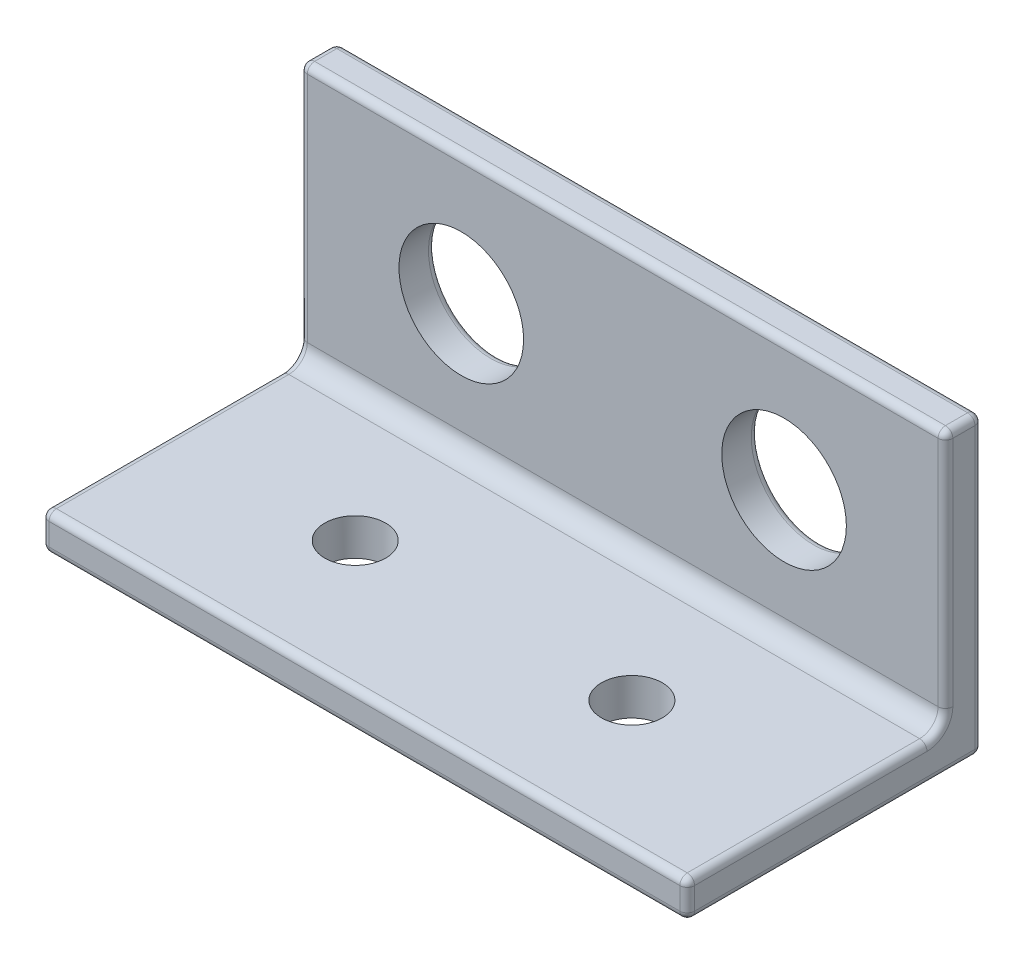
ISO-10303-21;
HEADER;
FILE_DESCRIPTION(('STEP AP214'),'2;1');
FILE_NAME('part.step','',(''),(''),'','','');
FILE_SCHEMA(('AUTOMOTIVE_DESIGN { 1 0 10303 214 1 1 1 1 }'));
ENDSEC;
DATA;
#1=APPLICATION_CONTEXT('core data for automotive mechanical design processes');
#2=APPLICATION_PROTOCOL_DEFINITION('international standard','automotive_design',2000,#1);
#3=PRODUCT_CONTEXT('',#1,'mechanical');
#4=PRODUCT('Part','Part','',(#3));
#5=PRODUCT_RELATED_PRODUCT_CATEGORY('part','',(#4));
#6=PRODUCT_DEFINITION_FORMATION('','',#4);
#7=PRODUCT_DEFINITION_CONTEXT('part definition',#1,'design');
#8=PRODUCT_DEFINITION('design','',#6,#7);
#9=PRODUCT_DEFINITION_SHAPE('','',#8);
#10=(LENGTH_UNIT() NAMED_UNIT(*) SI_UNIT(.MILLI.,.METRE.));
#11=(NAMED_UNIT(*) PLANE_ANGLE_UNIT() SI_UNIT($,.RADIAN.));
#12=(NAMED_UNIT(*) SI_UNIT($,.STERADIAN.) SOLID_ANGLE_UNIT());
#13=UNCERTAINTY_MEASURE_WITH_UNIT(LENGTH_MEASURE(1.E-05),#10,'distance_accuracy_value','');
#14=(GEOMETRIC_REPRESENTATION_CONTEXT(3) GLOBAL_UNCERTAINTY_ASSIGNED_CONTEXT((#13)) GLOBAL_UNIT_ASSIGNED_CONTEXT((#10,
#11,#12)) REPRESENTATION_CONTEXT('',''));
#15=CARTESIAN_POINT('',(0.,0.,0.));
#16=DIRECTION('',(0.,0.,1.));
#17=DIRECTION('',(1.,0.,0.));
#18=AXIS2_PLACEMENT_3D('',#15,#16,#17);
#19=CARTESIAN_POINT('',(17.5,2.,2.));
#20=DIRECTION('',(0.,0.,-1.));
#21=DIRECTION('',(0.,1.,0.));
#22=AXIS2_PLACEMENT_3D('',#19,#20,#21);
#23=PLANE('',#22);
#24=CARTESIAN_POINT('',(-8.75,9.,2.));
#25=DIRECTION('',(0.,0.,1.));
#26=DIRECTION('',(1.,0.,0.));
#27=AXIS2_PLACEMENT_3D('',#24,#25,#26);
#28=CIRCLE('',#27,3.3782);
#29=CARTESIAN_POINT('',(-5.3718,9.,2.));
#30=VERTEX_POINT('',#29);
#31=EDGE_CURVE('E392',#30,#30,#28,.T.);
#32=ORIENTED_EDGE('',*,*,#31,.F.);
#33=EDGE_LOOP('',(#32));
#34=FACE_BOUND('',#33,.T.);
#35=CARTESIAN_POINT('',(8.75,9.,2.));
#36=DIRECTION('',(0.,0.,1.));
#37=DIRECTION('',(1.,0.,0.));
#38=AXIS2_PLACEMENT_3D('',#35,#36,#37);
#39=CIRCLE('',#38,3.3782);
#40=CARTESIAN_POINT('',(12.1282,9.,2.));
#41=VERTEX_POINT('',#40);
#42=EDGE_CURVE('E395',#41,#41,#39,.T.);
#43=ORIENTED_EDGE('',*,*,#42,.F.);
#44=EDGE_LOOP('',(#43));
#45=FACE_BOUND('',#44,.T.);
#46=DIRECTION('',(-1.,0.,0.));
#47=VECTOR('',#46,1.);
#48=CARTESIAN_POINT('',(17.5,15.6,2.));
#49=LINE('',#48,#47);
#50=CARTESIAN_POINT('',(17.1,15.6,2.));
#51=VERTEX_POINT('',#50);
#52=CARTESIAN_POINT('',(-17.1,15.6,2.));
#53=VERTEX_POINT('',#52);
#54=EDGE_CURVE('E241',#51,#53,#49,.T.);
#55=ORIENTED_EDGE('',*,*,#54,.T.);
#56=DIRECTION('',(0.,-1.,0.));
#57=VECTOR('',#56,1.);
#58=CARTESIAN_POINT('',(-17.1,3.,2.));
#59=LINE('',#58,#57);
#60=CARTESIAN_POINT('',(-17.1,3.,2.));
#61=VERTEX_POINT('',#60);
#62=EDGE_CURVE('E244',#53,#61,#59,.T.);
#63=ORIENTED_EDGE('',*,*,#62,.T.);
#64=DIRECTION('',(-1.,0.,0.));
#65=VECTOR('',#64,1.);
#66=CARTESIAN_POINT('',(17.5,3.,2.));
#67=LINE('',#66,#65);
#68=CARTESIAN_POINT('',(17.1,3.,2.));
#69=VERTEX_POINT('',#68);
#70=EDGE_CURVE('E202',#61,#69,#67,.F.);
#71=ORIENTED_EDGE('',*,*,#70,.T.);
#72=DIRECTION('',(0.,-1.,0.));
#73=VECTOR('',#72,1.);
#74=CARTESIAN_POINT('',(17.1,2.,2.));
#75=LINE('',#74,#73);
#76=EDGE_CURVE('E239',#69,#51,#75,.F.);
#77=ORIENTED_EDGE('',*,*,#76,.T.);
#78=EDGE_LOOP('',(#55,#63,#71,#77));
#79=FACE_BOUND('',#78,.T.);
#80=ADVANCED_FACE('F35',(#34,#45,#79),#23,.F.);
#81=CARTESIAN_POINT('',(17.5,2.,16.));
#82=DIRECTION('',(0.,-1.,0.));
#83=DIRECTION('',(0.,0.,-1.));
#84=AXIS2_PLACEMENT_3D('',#81,#82,#83);
#85=PLANE('',#84);
#86=CARTESIAN_POINT('',(-7.5,2.,9.));
#87=DIRECTION('',(0.,-1.,0.));
#88=DIRECTION('',(0.,0.,-1.));
#89=AXIS2_PLACEMENT_3D('',#86,#87,#88);
#90=CIRCLE('',#89,1.65);
#91=CARTESIAN_POINT('',(-7.5,2.,7.35));
#92=VERTEX_POINT('',#91);
#93=EDGE_CURVE('E389',#92,#92,#90,.T.);
#94=ORIENTED_EDGE('',*,*,#93,.T.);
#95=EDGE_LOOP('',(#94));
#96=FACE_BOUND('',#95,.T.);
#97=CARTESIAN_POINT('',(7.5,2.,9.));
#98=DIRECTION('',(0.,-1.,0.));
#99=DIRECTION('',(0.,0.,-1.));
#100=AXIS2_PLACEMENT_3D('',#97,#98,#99);
#101=CIRCLE('',#100,1.65);
#102=CARTESIAN_POINT('',(7.5,2.,7.35));
#103=VERTEX_POINT('',#102);
#104=EDGE_CURVE('E384',#103,#103,#101,.T.);
#105=ORIENTED_EDGE('',*,*,#104,.T.);
#106=EDGE_LOOP('',(#105));
#107=FACE_BOUND('',#106,.T.);
#108=DIRECTION('',(-1.,0.,0.));
#109=VECTOR('',#108,1.);
#110=CARTESIAN_POINT('',(-17.5,2.,3.));
#111=LINE('',#110,#109);
#112=CARTESIAN_POINT('',(17.1,2.,3.));
#113=VERTEX_POINT('',#112);
#114=CARTESIAN_POINT('',(-17.1,2.,3.));
#115=VERTEX_POINT('',#114);
#116=EDGE_CURVE('E205',#113,#115,#111,.T.);
#117=ORIENTED_EDGE('',*,*,#116,.T.);
#118=DIRECTION('',(0.,0.,1.));
#119=VECTOR('',#118,1.);
#120=CARTESIAN_POINT('',(-17.1,2.,16.));
#121=LINE('',#120,#119);
#122=CARTESIAN_POINT('',(-17.1,2.,15.6));
#123=VERTEX_POINT('',#122);
#124=EDGE_CURVE('E269',#115,#123,#121,.T.);
#125=ORIENTED_EDGE('',*,*,#124,.T.);
#126=DIRECTION('',(-1.,0.,0.));
#127=VECTOR('',#126,1.);
#128=CARTESIAN_POINT('',(17.5,2.,15.6));
#129=LINE('',#128,#127);
#130=CARTESIAN_POINT('',(17.1,2.,15.6));
#131=VERTEX_POINT('',#130);
#132=EDGE_CURVE('E267',#123,#131,#129,.F.);
#133=ORIENTED_EDGE('',*,*,#132,.T.);
#134=DIRECTION('',(0.,0.,1.));
#135=VECTOR('',#134,1.);
#136=CARTESIAN_POINT('',(17.1,2.,16.));
#137=LINE('',#136,#135);
#138=EDGE_CURVE('E265',#131,#113,#137,.F.);
#139=ORIENTED_EDGE('',*,*,#138,.T.);
#140=EDGE_LOOP('',(#117,#125,#133,#139));
#141=FACE_BOUND('',#140,.T.);
#142=ADVANCED_FACE('F401',(#96,#107,#141),#85,.F.);
#143=CARTESIAN_POINT('',(17.5,0.,16.));
#144=DIRECTION('',(0.,0.,-1.));
#145=DIRECTION('',(-1.,0.,0.));
#146=AXIS2_PLACEMENT_3D('',#143,#144,#145);
#147=PLANE('',#146);
#148=DIRECTION('',(-1.,0.,0.));
#149=VECTOR('',#148,1.);
#150=CARTESIAN_POINT('',(17.5,1.6,16.));
#151=LINE('',#150,#149);
#152=CARTESIAN_POINT('',(17.1,1.6,16.));
#153=VERTEX_POINT('',#152);
#154=CARTESIAN_POINT('',(-17.1,1.6,16.));
#155=VERTEX_POINT('',#154);
#156=EDGE_CURVE('E275',#153,#155,#151,.T.);
#157=ORIENTED_EDGE('',*,*,#156,.T.);
#158=DIRECTION('',(0.,-1.,0.));
#159=VECTOR('',#158,1.);
#160=CARTESIAN_POINT('',(-17.1,0.,16.));
#161=LINE('',#160,#159);
#162=CARTESIAN_POINT('',(-17.1,0.399999999999998,16.));
#163=VERTEX_POINT('',#162);
#164=EDGE_CURVE('E278',#155,#163,#161,.T.);
#165=ORIENTED_EDGE('',*,*,#164,.T.);
#166=DIRECTION('',(-1.,0.,0.));
#167=VECTOR('',#166,1.);
#168=CARTESIAN_POINT('',(17.5,0.399999999999998,16.));
#169=LINE('',#168,#167);
#170=CARTESIAN_POINT('',(17.1,0.399999999999998,16.));
#171=VERTEX_POINT('',#170);
#172=EDGE_CURVE('E273',#163,#171,#169,.F.);
#173=ORIENTED_EDGE('',*,*,#172,.T.);
#174=DIRECTION('',(0.,-1.,0.));
#175=VECTOR('',#174,1.);
#176=CARTESIAN_POINT('',(17.1,0.,16.));
#177=LINE('',#176,#175);
#178=EDGE_CURVE('E271',#171,#153,#177,.F.);
#179=ORIENTED_EDGE('',*,*,#178,.T.);
#180=EDGE_LOOP('',(#157,#165,#173,#179));
#181=FACE_BOUND('',#180,.T.);
#182=ADVANCED_FACE('F424',(#181),#147,.F.);
#183=CARTESIAN_POINT('',(17.5,0.,0.));
#184=DIRECTION('',(0.,1.,0.));
#185=DIRECTION('',(0.,0.,1.));
#186=AXIS2_PLACEMENT_3D('',#183,#184,#185);
#187=PLANE('',#186);
#188=DIRECTION('',(0.,0.,-1.));
#189=VECTOR('',#188,1.);
#190=CARTESIAN_POINT('',(-17.1,0.,0.));
#191=LINE('',#190,#189);
#192=CARTESIAN_POINT('',(-17.1,0.,15.6));
#193=VERTEX_POINT('',#192);
#194=CARTESIAN_POINT('',(-17.1,0.,0.4));
#195=VERTEX_POINT('',#194);
#196=EDGE_CURVE('E221',#193,#195,#191,.T.);
#197=ORIENTED_EDGE('',*,*,#196,.T.);
#198=DIRECTION('',(-1.,0.,0.));
#199=VECTOR('',#198,1.);
#200=CARTESIAN_POINT('',(17.5,0.,0.4));
#201=LINE('',#200,#199);
#202=CARTESIAN_POINT('',(17.1,0.,0.4));
#203=VERTEX_POINT('',#202);
#204=EDGE_CURVE('E223',#195,#203,#201,.F.);
#205=ORIENTED_EDGE('',*,*,#204,.T.);
#206=DIRECTION('',(0.,0.,-1.));
#207=VECTOR('',#206,1.);
#208=CARTESIAN_POINT('',(17.1,0.,0.));
#209=LINE('',#208,#207);
#210=CARTESIAN_POINT('',(17.1,0.,15.6));
#211=VERTEX_POINT('',#210);
#212=EDGE_CURVE('E217',#203,#211,#209,.F.);
#213=ORIENTED_EDGE('',*,*,#212,.T.);
#214=DIRECTION('',(-1.,0.,0.));
#215=VECTOR('',#214,1.);
#216=CARTESIAN_POINT('',(17.5,0.,15.6));
#217=LINE('',#216,#215);
#218=EDGE_CURVE('E219',#211,#193,#217,.T.);
#219=ORIENTED_EDGE('',*,*,#218,.T.);
#220=EDGE_LOOP('',(#197,#205,#213,#219));
#221=FACE_BOUND('',#220,.T.);
#222=CARTESIAN_POINT('',(-7.5,0.,9.));
#223=DIRECTION('',(0.,1.,0.));
#224=DIRECTION('',(0.,0.,1.));
#225=AXIS2_PLACEMENT_3D('',#222,#223,#224);
#226=CIRCLE('',#225,1.65);
#227=CARTESIAN_POINT('',(-7.5,0.,10.65));
#228=VERTEX_POINT('',#227);
#229=EDGE_CURVE('E379',#228,#228,#226,.T.);
#230=ORIENTED_EDGE('',*,*,#229,.T.);
#231=EDGE_LOOP('',(#230));
#232=FACE_BOUND('',#231,.T.);
#233=CARTESIAN_POINT('',(7.5,0.,9.));
#234=DIRECTION('',(0.,1.,0.));
#235=DIRECTION('',(0.,0.,-1.));
#236=AXIS2_PLACEMENT_3D('',#233,#234,#235);
#237=CIRCLE('',#236,1.65);
#238=CARTESIAN_POINT('',(7.5,0.,7.35));
#239=VERTEX_POINT('',#238);
#240=EDGE_CURVE('E373',#239,#239,#237,.T.);
#241=ORIENTED_EDGE('',*,*,#240,.T.);
#242=EDGE_LOOP('',(#241));
#243=FACE_BOUND('',#242,.T.);
#244=ADVANCED_FACE('F595',(#221,#232,#243),#187,.F.);
#245=CARTESIAN_POINT('',(17.5,16.,0.));
#246=DIRECTION('',(0.,0.,1.));
#247=DIRECTION('',(0.,-1.,0.));
#248=AXIS2_PLACEMENT_3D('',#245,#246,#247);
#249=PLANE('',#248);
#250=CARTESIAN_POINT('',(8.75,9.,0.));
#251=DIRECTION('',(0.,0.,1.));
#252=DIRECTION('',(0.,-1.,0.));
#253=AXIS2_PLACEMENT_3D('',#250,#251,#252);
#254=CIRCLE('',#253,3.7782);
#255=CARTESIAN_POINT('',(8.75,5.2218,0.));
#256=VERTEX_POINT('',#255);
#257=EDGE_CURVE('E214',#256,#256,#254,.T.);
#258=ORIENTED_EDGE('',*,*,#257,.T.);
#259=EDGE_LOOP('',(#258));
#260=FACE_BOUND('',#259,.T.);
#261=CARTESIAN_POINT('',(-8.75,9.,0.));
#262=DIRECTION('',(0.,0.,1.));
#263=DIRECTION('',(0.,-1.,0.));
#264=AXIS2_PLACEMENT_3D('',#261,#262,#263);
#265=CIRCLE('',#264,3.7782);
#266=CARTESIAN_POINT('',(-8.75,5.2218,0.));
#267=VERTEX_POINT('',#266);
#268=EDGE_CURVE('E211',#267,#267,#265,.T.);
#269=ORIENTED_EDGE('',*,*,#268,.T.);
#270=EDGE_LOOP('',(#269));
#271=FACE_BOUND('',#270,.T.);
#272=DIRECTION('',(-1.,0.,0.));
#273=VECTOR('',#272,1.);
#274=CARTESIAN_POINT('',(17.5,0.399999999999999,0.));
#275=LINE('',#274,#273);
#276=CARTESIAN_POINT('',(17.1,0.399999999999999,0.));
#277=VERTEX_POINT('',#276);
#278=CARTESIAN_POINT('',(-17.1,0.399999999999999,0.));
#279=VERTEX_POINT('',#278);
#280=EDGE_CURVE('E176',#277,#279,#275,.T.);
#281=ORIENTED_EDGE('',*,*,#280,.T.);
#282=DIRECTION('',(0.,1.,0.));
#283=VECTOR('',#282,1.);
#284=CARTESIAN_POINT('',(-17.1,16.,0.));
#285=LINE('',#284,#283);
#286=CARTESIAN_POINT('',(-17.1,15.6,0.));
#287=VERTEX_POINT('',#286);
#288=EDGE_CURVE('E172',#279,#287,#285,.T.);
#289=ORIENTED_EDGE('',*,*,#288,.T.);
#290=DIRECTION('',(-1.,0.,0.));
#291=VECTOR('',#290,1.);
#292=CARTESIAN_POINT('',(17.5,15.6,0.));
#293=LINE('',#292,#291);
#294=CARTESIAN_POINT('',(17.1,15.6,0.));
#295=VERTEX_POINT('',#294);
#296=EDGE_CURVE('E164',#287,#295,#293,.F.);
#297=ORIENTED_EDGE('',*,*,#296,.T.);
#298=DIRECTION('',(0.,1.,0.));
#299=VECTOR('',#298,1.);
#300=CARTESIAN_POINT('',(17.1,16.,0.));
#301=LINE('',#300,#299);
#302=EDGE_CURVE('E169',#295,#277,#301,.F.);
#303=ORIENTED_EDGE('',*,*,#302,.T.);
#304=EDGE_LOOP('',(#281,#289,#297,#303));
#305=FACE_BOUND('',#304,.T.);
#306=ADVANCED_FACE('F167',(#260,#271,#305),#249,.F.);
#307=CARTESIAN_POINT('',(17.5,16.,2.));
#308=DIRECTION('',(0.,-1.,0.));
#309=DIRECTION('',(0.,0.,-1.));
#310=AXIS2_PLACEMENT_3D('',#307,#308,#309);
#311=PLANE('',#310);
#312=DIRECTION('',(-1.,0.,0.));
#313=VECTOR('',#312,1.);
#314=CARTESIAN_POINT('',(17.5,16.,0.400000000000001));
#315=LINE('',#314,#313);
#316=CARTESIAN_POINT('',(17.1,16.,0.400000000000001));
#317=VERTEX_POINT('',#316);
#318=CARTESIAN_POINT('',(-17.1,16.,0.400000000000001));
#319=VERTEX_POINT('',#318);
#320=EDGE_CURVE('E184',#317,#319,#315,.T.);
#321=ORIENTED_EDGE('',*,*,#320,.T.);
#322=DIRECTION('',(0.,0.,1.));
#323=VECTOR('',#322,1.);
#324=CARTESIAN_POINT('',(-17.1,16.,2.));
#325=LINE('',#324,#323);
#326=CARTESIAN_POINT('',(-17.1,16.,1.6));
#327=VERTEX_POINT('',#326);
#328=EDGE_CURVE('E237',#319,#327,#325,.T.);
#329=ORIENTED_EDGE('',*,*,#328,.T.);
#330=DIRECTION('',(-1.,0.,0.));
#331=VECTOR('',#330,1.);
#332=CARTESIAN_POINT('',(17.5,16.,1.6));
#333=LINE('',#332,#331);
#334=CARTESIAN_POINT('',(17.1,16.,1.6));
#335=VERTEX_POINT('',#334);
#336=EDGE_CURVE('E234',#327,#335,#333,.F.);
#337=ORIENTED_EDGE('',*,*,#336,.T.);
#338=DIRECTION('',(0.,0.,1.));
#339=VECTOR('',#338,1.);
#340=CARTESIAN_POINT('',(17.1,16.,2.));
#341=LINE('',#340,#339);
#342=EDGE_CURVE('E232',#335,#317,#341,.F.);
#343=ORIENTED_EDGE('',*,*,#342,.T.);
#344=EDGE_LOOP('',(#321,#329,#337,#343));
#345=FACE_BOUND('',#344,.T.);
#346=ADVANCED_FACE('F470',(#345),#311,.F.);
#347=CARTESIAN_POINT('',(17.5,0.,0.));
#348=DIRECTION('',(-1.,0.,0.));
#349=DIRECTION('',(0.,0.,1.));
#350=AXIS2_PLACEMENT_3D('',#347,#348,#349);
#351=PLANE('',#350);
#352=DIRECTION('',(0.,1.,0.));
#353=VECTOR('',#352,1.);
#354=CARTESIAN_POINT('',(17.5,0.,0.4));
#355=LINE('',#354,#353);
#356=CARTESIAN_POINT('',(17.5,0.4,0.4));
#357=VERTEX_POINT('',#356);
#358=CARTESIAN_POINT('',(17.5,15.6,0.400000000000001));
#359=VERTEX_POINT('',#358);
#360=EDGE_CURVE('E44',#357,#359,#355,.T.);
#361=ORIENTED_EDGE('',*,*,#360,.T.);
#362=DIRECTION('',(0.,0.,1.));
#363=VECTOR('',#362,1.);
#364=CARTESIAN_POINT('',(17.5,15.6,0.));
#365=LINE('',#364,#363);
#366=CARTESIAN_POINT('',(17.5,15.6,1.6));
#367=VERTEX_POINT('',#366);
#368=EDGE_CURVE('E11',#359,#367,#365,.T.);
#369=ORIENTED_EDGE('',*,*,#368,.T.);
#370=DIRECTION('',(0.,-1.,0.));
#371=VECTOR('',#370,1.);
#372=CARTESIAN_POINT('',(17.5,0.,1.6));
#373=LINE('',#372,#371);
#374=CARTESIAN_POINT('',(17.5,3.,1.6));
#375=VERTEX_POINT('',#374);
#376=EDGE_CURVE('E280',#367,#375,#373,.T.);
#377=ORIENTED_EDGE('',*,*,#376,.T.);
#378=CARTESIAN_POINT('',(17.5,3.,3.));
#379=DIRECTION('',(-1.,0.,0.));
#380=DIRECTION('',(0.,0.,1.));
#381=AXIS2_PLACEMENT_3D('',#378,#379,#380);
#382=CIRCLE('',#381,1.4);
#383=CARTESIAN_POINT('',(17.5,1.6,3.));
#384=VERTEX_POINT('',#383);
#385=EDGE_CURVE('E282',#375,#384,#382,.T.);
#386=ORIENTED_EDGE('',*,*,#385,.T.);
#387=DIRECTION('',(0.,0.,1.));
#388=VECTOR('',#387,1.);
#389=CARTESIAN_POINT('',(17.5,1.6,0.));
#390=LINE('',#389,#388);
#391=CARTESIAN_POINT('',(17.5,1.6,15.6));
#392=VERTEX_POINT('',#391);
#393=EDGE_CURVE('E284',#384,#392,#390,.T.);
#394=ORIENTED_EDGE('',*,*,#393,.T.);
#395=DIRECTION('',(0.,-1.,0.));
#396=VECTOR('',#395,1.);
#397=CARTESIAN_POINT('',(17.5,0.,15.6));
#398=LINE('',#397,#396);
#399=CARTESIAN_POINT('',(17.5,0.399999999999998,15.6));
#400=VERTEX_POINT('',#399);
#401=EDGE_CURVE('E286',#392,#400,#398,.T.);
#402=ORIENTED_EDGE('',*,*,#401,.T.);
#403=DIRECTION('',(0.,0.,-1.));
#404=VECTOR('',#403,1.);
#405=CARTESIAN_POINT('',(17.5,0.4,0.));
#406=LINE('',#405,#404);
#407=EDGE_CURVE('E55',#400,#357,#406,.T.);
#408=ORIENTED_EDGE('',*,*,#407,.T.);
#409=EDGE_LOOP('',(#361,#369,#377,#386,#394,#402,#408));
#410=FACE_BOUND('',#409,.T.);
#411=ADVANCED_FACE('F476',(#410),#351,.F.);
#412=CARTESIAN_POINT('',(-17.5,0.,0.));
#413=DIRECTION('',(-1.,0.,0.));
#414=DIRECTION('',(0.,0.,1.));
#415=AXIS2_PLACEMENT_3D('',#412,#413,#414);
#416=PLANE('',#415);
#417=DIRECTION('',(0.,0.,1.));
#418=VECTOR('',#417,1.);
#419=CARTESIAN_POINT('',(-17.5,15.6,0.));
#420=LINE('',#419,#418);
#421=CARTESIAN_POINT('',(-17.5,15.6,1.6));
#422=VERTEX_POINT('',#421);
#423=CARTESIAN_POINT('',(-17.5,15.6,0.400000000000001));
#424=VERTEX_POINT('',#423);
#425=EDGE_CURVE('E257',#422,#424,#420,.F.);
#426=ORIENTED_EDGE('',*,*,#425,.T.);
#427=DIRECTION('',(0.,1.,0.));
#428=VECTOR('',#427,1.);
#429=CARTESIAN_POINT('',(-17.5,0.,0.4));
#430=LINE('',#429,#428);
#431=CARTESIAN_POINT('',(-17.5,0.4,0.4));
#432=VERTEX_POINT('',#431);
#433=EDGE_CURVE('E259',#424,#432,#430,.F.);
#434=ORIENTED_EDGE('',*,*,#433,.T.);
#435=DIRECTION('',(0.,0.,-1.));
#436=VECTOR('',#435,1.);
#437=CARTESIAN_POINT('',(-17.5,0.399999999999998,16.));
#438=LINE('',#437,#436);
#439=CARTESIAN_POINT('',(-17.5,0.399999999999998,15.6));
#440=VERTEX_POINT('',#439);
#441=EDGE_CURVE('E248',#432,#440,#438,.F.);
#442=ORIENTED_EDGE('',*,*,#441,.T.);
#443=DIRECTION('',(0.,-1.,0.));
#444=VECTOR('',#443,1.);
#445=CARTESIAN_POINT('',(-17.5,2.,15.6));
#446=LINE('',#445,#444);
#447=CARTESIAN_POINT('',(-17.5,1.6,15.6));
#448=VERTEX_POINT('',#447);
#449=EDGE_CURVE('E246',#440,#448,#446,.F.);
#450=ORIENTED_EDGE('',*,*,#449,.T.);
#451=DIRECTION('',(0.,0.,1.));
#452=VECTOR('',#451,1.);
#453=CARTESIAN_POINT('',(-17.5,1.6,3.));
#454=LINE('',#453,#452);
#455=CARTESIAN_POINT('',(-17.5,1.6,3.));
#456=VERTEX_POINT('',#455);
#457=EDGE_CURVE('E250',#448,#456,#454,.F.);
#458=ORIENTED_EDGE('',*,*,#457,.T.);
#459=CARTESIAN_POINT('',(-17.5,3.,3.));
#460=DIRECTION('',(-1.,0.,0.));
#461=DIRECTION('',(0.,0.,1.));
#462=AXIS2_PLACEMENT_3D('',#459,#460,#461);
#463=CIRCLE('',#462,1.4);
#464=CARTESIAN_POINT('',(-17.5,3.,1.6));
#465=VERTEX_POINT('',#464);
#466=EDGE_CURVE('E252',#456,#465,#463,.F.);
#467=ORIENTED_EDGE('',*,*,#466,.T.);
#468=DIRECTION('',(0.,-1.,0.));
#469=VECTOR('',#468,1.);
#470=CARTESIAN_POINT('',(-17.5,16.,1.6));
#471=LINE('',#470,#469);
#472=EDGE_CURVE('E255',#465,#422,#471,.F.);
#473=ORIENTED_EDGE('',*,*,#472,.T.);
#474=EDGE_LOOP('',(#426,#434,#442,#450,#458,#467,#473));
#475=FACE_BOUND('',#474,.T.);
#476=ADVANCED_FACE('F635',(#475),#416,.T.);
#477=CARTESIAN_POINT('',(8.75,9.,2.));
#478=DIRECTION('',(0.,0.,1.));
#479=DIRECTION('',(1.,0.,0.));
#480=AXIS2_PLACEMENT_3D('',#477,#478,#479);
#481=CYLINDRICAL_SURFACE('',#480,3.3782);
#482=CARTESIAN_POINT('',(8.75,9.,0.400000000000001));
#483=DIRECTION('',(0.,0.,1.));
#484=DIRECTION('',(0.,-1.,0.));
#485=AXIS2_PLACEMENT_3D('',#482,#483,#484);
#486=CIRCLE('',#485,3.3782);
#487=CARTESIAN_POINT('',(8.75,5.6218,0.4));
#488=VERTEX_POINT('',#487);
#489=EDGE_CURVE('E226',#488,#488,#486,.F.);
#490=ORIENTED_EDGE('',*,*,#489,.T.);
#491=EDGE_LOOP('',(#490));
#492=FACE_BOUND('',#491,.T.);
#493=ORIENTED_EDGE('',*,*,#42,.T.);
#494=EDGE_LOOP('',(#493));
#495=FACE_BOUND('',#494,.T.);
#496=ADVANCED_FACE('F644',(#492,#495),#481,.F.);
#497=CARTESIAN_POINT('',(-8.75,9.,2.));
#498=DIRECTION('',(0.,0.,1.));
#499=DIRECTION('',(1.,0.,0.));
#500=AXIS2_PLACEMENT_3D('',#497,#498,#499);
#501=CYLINDRICAL_SURFACE('',#500,3.3782);
#502=CARTESIAN_POINT('',(-8.75,9.,0.400000000000001));
#503=DIRECTION('',(0.,0.,1.));
#504=DIRECTION('',(0.,-1.,0.));
#505=AXIS2_PLACEMENT_3D('',#502,#503,#504);
#506=CIRCLE('',#505,3.3782);
#507=CARTESIAN_POINT('',(-8.75,5.6218,0.4));
#508=VERTEX_POINT('',#507);
#509=EDGE_CURVE('E229',#508,#508,#506,.F.);
#510=ORIENTED_EDGE('',*,*,#509,.T.);
#511=EDGE_LOOP('',(#510));
#512=FACE_BOUND('',#511,.T.);
#513=ORIENTED_EDGE('',*,*,#31,.T.);
#514=EDGE_LOOP('',(#513));
#515=FACE_BOUND('',#514,.T.);
#516=ADVANCED_FACE('F653',(#512,#515),#501,.F.);
#517=CARTESIAN_POINT('',(7.5,0.,9.));
#518=DIRECTION('',(0.,1.,0.));
#519=DIRECTION('',(0.,0.,1.));
#520=AXIS2_PLACEMENT_3D('',#517,#518,#519);
#521=CYLINDRICAL_SURFACE('',#520,1.65);
#522=ORIENTED_EDGE('',*,*,#240,.F.);
#523=EDGE_LOOP('',(#522));
#524=FACE_BOUND('',#523,.T.);
#525=ORIENTED_EDGE('',*,*,#104,.F.);
#526=EDGE_LOOP('',(#525));
#527=FACE_BOUND('',#526,.T.);
#528=ADVANCED_FACE('F663',(#524,#527),#521,.F.);
#529=CARTESIAN_POINT('',(-7.5,0.,9.));
#530=DIRECTION('',(0.,1.,0.));
#531=DIRECTION('',(0.,0.,1.));
#532=AXIS2_PLACEMENT_3D('',#529,#530,#531);
#533=CYLINDRICAL_SURFACE('',#532,1.65);
#534=ORIENTED_EDGE('',*,*,#229,.F.);
#535=EDGE_LOOP('',(#534));
#536=FACE_BOUND('',#535,.T.);
#537=ORIENTED_EDGE('',*,*,#93,.F.);
#538=EDGE_LOOP('',(#537));
#539=FACE_BOUND('',#538,.T.);
#540=ADVANCED_FACE('F511',(#536,#539),#533,.F.);
#541=CARTESIAN_POINT('',(17.5,3.,3.));
#542=DIRECTION('',(1.,0.,0.));
#543=DIRECTION('',(0.,0.,-1.));
#544=AXIS2_PLACEMENT_3D('',#541,#542,#543);
#545=CYLINDRICAL_SURFACE('',#544,1.);
#546=ORIENTED_EDGE('',*,*,#70,.F.);
#547=CARTESIAN_POINT('',(-17.1,3.,3.));
#548=DIRECTION('',(-1.,0.,0.));
#549=DIRECTION('',(0.,0.,1.));
#550=AXIS2_PLACEMENT_3D('',#547,#548,#549);
#551=CIRCLE('',#550,1.);
#552=EDGE_CURVE('E263',#61,#115,#551,.T.);
#553=ORIENTED_EDGE('',*,*,#552,.T.);
#554=ORIENTED_EDGE('',*,*,#116,.F.);
#555=CARTESIAN_POINT('',(17.1,3.,3.));
#556=DIRECTION('',(-1.,0.,0.));
#557=DIRECTION('',(0.,0.,1.));
#558=AXIS2_PLACEMENT_3D('',#555,#556,#557);
#559=CIRCLE('',#558,1.);
#560=EDGE_CURVE('E261',#113,#69,#559,.F.);
#561=ORIENTED_EDGE('',*,*,#560,.T.);
#562=EDGE_LOOP('',(#546,#553,#554,#561));
#563=FACE_BOUND('',#562,.T.);
#564=ADVANCED_FACE('F508',(#563),#545,.F.);
#565=CARTESIAN_POINT('',(17.1,3.,3.));
#566=DIRECTION('',(-1.,0.,0.));
#567=DIRECTION('',(0.,0.,1.));
#568=AXIS2_PLACEMENT_3D('',#565,#566,#567);
#569=TOROIDAL_SURFACE('',#568,1.4,0.4);
#570=CARTESIAN_POINT('',(17.1,3.,1.6));
#571=DIRECTION('',(0.,1.,0.));
#572=DIRECTION('',(0.,0.,1.));
#573=AXIS2_PLACEMENT_3D('',#570,#571,#572);
#574=CIRCLE('',#573,0.4);
#575=EDGE_CURVE('E366',#69,#375,#574,.T.);
#576=ORIENTED_EDGE('',*,*,#575,.F.);
#577=ORIENTED_EDGE('',*,*,#560,.F.);
#578=CARTESIAN_POINT('',(17.1,1.6,3.));
#579=DIRECTION('',(0.,0.,1.));
#580=DIRECTION('',(1.,0.,0.));
#581=AXIS2_PLACEMENT_3D('',#578,#579,#580);
#582=CIRCLE('',#581,0.4);
#583=EDGE_CURVE('E39',#384,#113,#582,.T.);
#584=ORIENTED_EDGE('',*,*,#583,.F.);
#585=ORIENTED_EDGE('',*,*,#385,.F.);
#586=EDGE_LOOP('',(#576,#577,#584,#585));
#587=FACE_BOUND('',#586,.T.);
#588=ADVANCED_FACE('F480',(#587),#569,.T.);
#589=CARTESIAN_POINT('',(-17.1,3.,3.));
#590=DIRECTION('',(-1.,0.,0.));
#591=DIRECTION('',(0.,0.,1.));
#592=AXIS2_PLACEMENT_3D('',#589,#590,#591);
#593=TOROIDAL_SURFACE('',#592,1.4,0.4);
#594=CARTESIAN_POINT('',(-17.1,1.6,3.));
#595=DIRECTION('',(0.,0.,1.));
#596=DIRECTION('',(1.,0.,0.));
#597=AXIS2_PLACEMENT_3D('',#594,#595,#596);
#598=CIRCLE('',#597,0.4);
#599=EDGE_CURVE('E361',#115,#456,#598,.T.);
#600=ORIENTED_EDGE('',*,*,#599,.F.);
#601=ORIENTED_EDGE('',*,*,#552,.F.);
#602=CARTESIAN_POINT('',(-17.1,3.,1.6));
#603=DIRECTION('',(0.,1.,0.));
#604=DIRECTION('',(0.,0.,1.));
#605=AXIS2_PLACEMENT_3D('',#602,#603,#604);
#606=CIRCLE('',#605,0.4);
#607=EDGE_CURVE('E364',#465,#61,#606,.T.);
#608=ORIENTED_EDGE('',*,*,#607,.F.);
#609=ORIENTED_EDGE('',*,*,#466,.F.);
#610=EDGE_LOOP('',(#600,#601,#608,#609));
#611=FACE_BOUND('',#610,.T.);
#612=ADVANCED_FACE('F409',(#611),#593,.T.);
#613=CARTESIAN_POINT('',(17.1,1.6,0.));
#614=DIRECTION('',(0.,0.,1.));
#615=DIRECTION('',(1.,0.,0.));
#616=AXIS2_PLACEMENT_3D('',#613,#614,#615);
#617=CYLINDRICAL_SURFACE('',#616,0.4);
#618=ORIENTED_EDGE('',*,*,#583,.T.);
#619=ORIENTED_EDGE('',*,*,#138,.F.);
#620=CARTESIAN_POINT('',(17.1,1.6,15.6));
#621=DIRECTION('',(0.,0.,1.));
#622=DIRECTION('',(1.,0.,0.));
#623=AXIS2_PLACEMENT_3D('',#620,#621,#622);
#624=CIRCLE('',#623,0.4);
#625=EDGE_CURVE('E355',#392,#131,#624,.T.);
#626=ORIENTED_EDGE('',*,*,#625,.F.);
#627=ORIENTED_EDGE('',*,*,#393,.F.);
#628=EDGE_LOOP('',(#618,#619,#626,#627));
#629=FACE_BOUND('',#628,.T.);
#630=ADVANCED_FACE('F482',(#629),#617,.T.);
#631=CARTESIAN_POINT('',(17.1,0.,1.6));
#632=DIRECTION('',(0.,-1.,0.));
#633=DIRECTION('',(0.,0.,-1.));
#634=AXIS2_PLACEMENT_3D('',#631,#632,#633);
#635=CYLINDRICAL_SURFACE('',#634,0.4);
#636=ORIENTED_EDGE('',*,*,#575,.T.);
#637=ORIENTED_EDGE('',*,*,#376,.F.);
#638=CARTESIAN_POINT('',(17.1,15.6,1.6));
#639=DIRECTION('',(0.,1.,0.));
#640=DIRECTION('',(0.,0.,1.));
#641=AXIS2_PLACEMENT_3D('',#638,#639,#640);
#642=CIRCLE('',#641,0.4);
#643=EDGE_CURVE('E352',#51,#367,#642,.T.);
#644=ORIENTED_EDGE('',*,*,#643,.F.);
#645=ORIENTED_EDGE('',*,*,#76,.F.);
#646=EDGE_LOOP('',(#636,#637,#644,#645));
#647=FACE_BOUND('',#646,.T.);
#648=ADVANCED_FACE('F569',(#647),#635,.T.);
#649=CARTESIAN_POINT('',(17.5,15.6,1.6));
#650=DIRECTION('',(-1.,0.,0.));
#651=DIRECTION('',(0.,0.,1.));
#652=AXIS2_PLACEMENT_3D('',#649,#650,#651);
#653=CYLINDRICAL_SURFACE('',#652,0.4);
#654=CARTESIAN_POINT('',(-17.1,15.6,1.6));
#655=DIRECTION('',(-1.,0.,0.));
#656=DIRECTION('',(0.,0.,1.));
#657=AXIS2_PLACEMENT_3D('',#654,#655,#656);
#658=CIRCLE('',#657,0.4);
#659=EDGE_CURVE('E346',#53,#327,#658,.T.);
#660=ORIENTED_EDGE('',*,*,#659,.F.);
#661=ORIENTED_EDGE('',*,*,#54,.F.);
#662=CARTESIAN_POINT('',(17.1,15.6,1.6));
#663=DIRECTION('',(1.,0.,0.));
#664=DIRECTION('',(0.,0.,-1.));
#665=AXIS2_PLACEMENT_3D('',#662,#663,#664);
#666=CIRCLE('',#665,0.4);
#667=EDGE_CURVE('E349',#335,#51,#666,.T.);
#668=ORIENTED_EDGE('',*,*,#667,.F.);
#669=ORIENTED_EDGE('',*,*,#336,.F.);
#670=EDGE_LOOP('',(#660,#661,#668,#669));
#671=FACE_BOUND('',#670,.T.);
#672=ADVANCED_FACE('F565',(#671),#653,.T.);
#673=CARTESIAN_POINT('',(-17.1,2.,1.6));
#674=DIRECTION('',(0.,1.,0.));
#675=DIRECTION('',(0.,0.,1.));
#676=AXIS2_PLACEMENT_3D('',#673,#674,#675);
#677=CYLINDRICAL_SURFACE('',#676,0.4);
#678=ORIENTED_EDGE('',*,*,#607,.T.);
#679=ORIENTED_EDGE('',*,*,#62,.F.);
#680=CARTESIAN_POINT('',(-17.1,15.6,1.6));
#681=DIRECTION('',(0.,1.,0.));
#682=DIRECTION('',(0.,0.,1.));
#683=AXIS2_PLACEMENT_3D('',#680,#681,#682);
#684=CIRCLE('',#683,0.4);
#685=EDGE_CURVE('E344',#422,#53,#684,.T.);
#686=ORIENTED_EDGE('',*,*,#685,.F.);
#687=ORIENTED_EDGE('',*,*,#472,.F.);
#688=EDGE_LOOP('',(#678,#679,#686,#687));
#689=FACE_BOUND('',#688,.T.);
#690=ADVANCED_FACE('F566',(#689),#677,.T.);
#691=CARTESIAN_POINT('',(-17.1,1.6,16.));
#692=DIRECTION('',(0.,0.,-1.));
#693=DIRECTION('',(-1.,0.,0.));
#694=AXIS2_PLACEMENT_3D('',#691,#692,#693);
#695=CYLINDRICAL_SURFACE('',#694,0.4);
#696=ORIENTED_EDGE('',*,*,#599,.T.);
#697=ORIENTED_EDGE('',*,*,#457,.F.);
#698=CARTESIAN_POINT('',(-17.1,1.6,15.6));
#699=DIRECTION('',(0.,0.,1.));
#700=DIRECTION('',(1.,0.,0.));
#701=AXIS2_PLACEMENT_3D('',#698,#699,#700);
#702=CIRCLE('',#701,0.4);
#703=EDGE_CURVE('E341',#123,#448,#702,.T.);
#704=ORIENTED_EDGE('',*,*,#703,.F.);
#705=ORIENTED_EDGE('',*,*,#124,.F.);
#706=EDGE_LOOP('',(#696,#697,#704,#705));
#707=FACE_BOUND('',#706,.T.);
#708=ADVANCED_FACE('F414',(#707),#695,.T.);
#709=CARTESIAN_POINT('',(17.5,1.6,15.6));
#710=DIRECTION('',(-1.,0.,0.));
#711=DIRECTION('',(0.,0.,1.));
#712=AXIS2_PLACEMENT_3D('',#709,#710,#711);
#713=CYLINDRICAL_SURFACE('',#712,0.4);
#714=CARTESIAN_POINT('',(17.1,1.6,15.6));
#715=DIRECTION('',(1.,0.,0.));
#716=DIRECTION('',(0.,0.,-1.));
#717=AXIS2_PLACEMENT_3D('',#714,#715,#716);
#718=CIRCLE('',#717,0.4);
#719=EDGE_CURVE('E358',#131,#153,#718,.T.);
#720=ORIENTED_EDGE('',*,*,#719,.F.);
#721=ORIENTED_EDGE('',*,*,#132,.F.);
#722=CARTESIAN_POINT('',(-17.1,1.6,15.6));
#723=DIRECTION('',(-1.,0.,0.));
#724=DIRECTION('',(0.,0.,1.));
#725=AXIS2_PLACEMENT_3D('',#722,#723,#724);
#726=CIRCLE('',#725,0.4);
#727=EDGE_CURVE('E338',#155,#123,#726,.T.);
#728=ORIENTED_EDGE('',*,*,#727,.F.);
#729=ORIENTED_EDGE('',*,*,#156,.F.);
#730=EDGE_LOOP('',(#720,#721,#728,#729));
#731=FACE_BOUND('',#730,.T.);
#732=ADVANCED_FACE('F422',(#731),#713,.T.);
#733=CARTESIAN_POINT('',(17.1,1.6,15.6));
#734=DIRECTION('',(0.,0.,1.));
#735=DIRECTION('',(1.,0.,0.));
#736=AXIS2_PLACEMENT_3D('',#733,#734,#735);
#737=SPHERICAL_SURFACE('',#736,0.4);
#738=ORIENTED_EDGE('',*,*,#625,.T.);
#739=ORIENTED_EDGE('',*,*,#719,.T.);
#740=CARTESIAN_POINT('',(17.1,1.6,15.6));
#741=DIRECTION('',(0.,1.,0.));
#742=DIRECTION('',(0.,0.,1.));
#743=AXIS2_PLACEMENT_3D('',#740,#741,#742);
#744=CIRCLE('',#743,0.4);
#745=EDGE_CURVE('E335',#392,#153,#744,.F.);
#746=ORIENTED_EDGE('',*,*,#745,.F.);
#747=EDGE_LOOP('',(#738,#739,#746));
#748=FACE_BOUND('',#747,.T.);
#749=ADVANCED_FACE('F484',(#748),#737,.T.);
#750=CARTESIAN_POINT('',(17.1,15.6,1.6));
#751=DIRECTION('',(0.,0.,1.));
#752=DIRECTION('',(1.,0.,0.));
#753=AXIS2_PLACEMENT_3D('',#750,#751,#752);
#754=SPHERICAL_SURFACE('',#753,0.4);
#755=ORIENTED_EDGE('',*,*,#667,.T.);
#756=ORIENTED_EDGE('',*,*,#643,.T.);
#757=CARTESIAN_POINT('',(17.1,15.6,1.6));
#758=DIRECTION('',(0.,0.,1.));
#759=DIRECTION('',(1.,0.,0.));
#760=AXIS2_PLACEMENT_3D('',#757,#758,#759);
#761=CIRCLE('',#760,0.4);
#762=EDGE_CURVE('E333',#335,#367,#761,.F.);
#763=ORIENTED_EDGE('',*,*,#762,.F.);
#764=EDGE_LOOP('',(#755,#756,#763));
#765=FACE_BOUND('',#764,.T.);
#766=ADVANCED_FACE('F486',(#765),#754,.T.);
#767=CARTESIAN_POINT('',(-17.1,15.6,1.6));
#768=DIRECTION('',(0.,0.,1.));
#769=DIRECTION('',(1.,0.,0.));
#770=AXIS2_PLACEMENT_3D('',#767,#768,#769);
#771=SPHERICAL_SURFACE('',#770,0.4);
#772=ORIENTED_EDGE('',*,*,#685,.T.);
#773=ORIENTED_EDGE('',*,*,#659,.T.);
#774=CARTESIAN_POINT('',(-17.1,15.6,1.6));
#775=DIRECTION('',(0.,0.,1.));
#776=DIRECTION('',(1.,0.,0.));
#777=AXIS2_PLACEMENT_3D('',#774,#775,#776);
#778=CIRCLE('',#777,0.4);
#779=EDGE_CURVE('E330',#422,#327,#778,.F.);
#780=ORIENTED_EDGE('',*,*,#779,.F.);
#781=EDGE_LOOP('',(#772,#773,#780));
#782=FACE_BOUND('',#781,.T.);
#783=ADVANCED_FACE('F492',(#782),#771,.T.);
#784=CARTESIAN_POINT('',(-17.1,1.6,15.6));
#785=DIRECTION('',(0.,0.,1.));
#786=DIRECTION('',(1.,0.,0.));
#787=AXIS2_PLACEMENT_3D('',#784,#785,#786);
#788=SPHERICAL_SURFACE('',#787,0.4);
#789=ORIENTED_EDGE('',*,*,#727,.T.);
#790=ORIENTED_EDGE('',*,*,#703,.T.);
#791=CARTESIAN_POINT('',(-17.1,1.6,15.6));
#792=DIRECTION('',(0.,1.,0.));
#793=DIRECTION('',(0.,0.,1.));
#794=AXIS2_PLACEMENT_3D('',#791,#792,#793);
#795=CIRCLE('',#794,0.4);
#796=EDGE_CURVE('E327',#155,#448,#795,.F.);
#797=ORIENTED_EDGE('',*,*,#796,.F.);
#798=EDGE_LOOP('',(#789,#790,#797));
#799=FACE_BOUND('',#798,.T.);
#800=ADVANCED_FACE('F418',(#799),#788,.T.);
#801=CARTESIAN_POINT('',(17.1,0.,15.6));
#802=DIRECTION('',(0.,-1.,0.));
#803=DIRECTION('',(0.,0.,-1.));
#804=AXIS2_PLACEMENT_3D('',#801,#802,#803);
#805=CYLINDRICAL_SURFACE('',#804,0.4);
#806=ORIENTED_EDGE('',*,*,#745,.T.);
#807=ORIENTED_EDGE('',*,*,#178,.F.);
#808=CARTESIAN_POINT('',(17.1,0.399999999999998,15.6));
#809=DIRECTION('',(0.,-1.,0.));
#810=DIRECTION('',(0.,0.,-1.));
#811=AXIS2_PLACEMENT_3D('',#808,#809,#810);
#812=CIRCLE('',#811,0.4);
#813=EDGE_CURVE('E321',#400,#171,#812,.T.);
#814=ORIENTED_EDGE('',*,*,#813,.F.);
#815=ORIENTED_EDGE('',*,*,#401,.F.);
#816=EDGE_LOOP('',(#806,#807,#814,#815));
#817=FACE_BOUND('',#816,.T.);
#818=ADVANCED_FACE('F430',(#817),#805,.T.);
#819=CARTESIAN_POINT('',(17.1,15.6,0.));
#820=DIRECTION('',(0.,0.,1.));
#821=DIRECTION('',(1.,0.,0.));
#822=AXIS2_PLACEMENT_3D('',#819,#820,#821);
#823=CYLINDRICAL_SURFACE('',#822,0.4);
#824=ORIENTED_EDGE('',*,*,#762,.T.);
#825=ORIENTED_EDGE('',*,*,#368,.F.);
#826=CARTESIAN_POINT('',(17.1,15.6,0.400000000000001));
#827=DIRECTION('',(0.,0.,-1.));
#828=DIRECTION('',(-1.,0.,0.));
#829=AXIS2_PLACEMENT_3D('',#826,#827,#828);
#830=CIRCLE('',#829,0.4);
#831=EDGE_CURVE('E188',#317,#359,#830,.T.);
#832=ORIENTED_EDGE('',*,*,#831,.F.);
#833=ORIENTED_EDGE('',*,*,#342,.F.);
#834=EDGE_LOOP('',(#824,#825,#832,#833));
#835=FACE_BOUND('',#834,.T.);
#836=ADVANCED_FACE('F474',(#835),#823,.T.);
#837=CARTESIAN_POINT('',(17.5,15.6,0.400000000000001));
#838=DIRECTION('',(-1.,0.,0.));
#839=DIRECTION('',(0.,0.,1.));
#840=AXIS2_PLACEMENT_3D('',#837,#838,#839);
#841=CYLINDRICAL_SURFACE('',#840,0.4);
#842=CARTESIAN_POINT('',(-17.1,15.6,0.400000000000001));
#843=DIRECTION('',(-1.,0.,0.));
#844=DIRECTION('',(0.,0.,1.));
#845=AXIS2_PLACEMENT_3D('',#842,#843,#844);
#846=CIRCLE('',#845,0.4);
#847=EDGE_CURVE('E189',#319,#287,#846,.T.);
#848=ORIENTED_EDGE('',*,*,#847,.F.);
#849=ORIENTED_EDGE('',*,*,#320,.F.);
#850=CARTESIAN_POINT('',(17.1,15.6,0.400000000000001));
#851=DIRECTION('',(1.,0.,0.));
#852=DIRECTION('',(0.,0.,-1.));
#853=AXIS2_PLACEMENT_3D('',#850,#851,#852);
#854=CIRCLE('',#853,0.4);
#855=EDGE_CURVE('E180',#295,#317,#854,.T.);
#856=ORIENTED_EDGE('',*,*,#855,.F.);
#857=ORIENTED_EDGE('',*,*,#296,.F.);
#858=EDGE_LOOP('',(#848,#849,#856,#857));
#859=FACE_BOUND('',#858,.T.);
#860=ADVANCED_FACE('F182',(#859),#841,.T.);
#861=CARTESIAN_POINT('',(-17.1,15.6,2.));
#862=DIRECTION('',(0.,0.,-1.));
#863=DIRECTION('',(-1.,0.,0.));
#864=AXIS2_PLACEMENT_3D('',#861,#862,#863);
#865=CYLINDRICAL_SURFACE('',#864,0.4);
#866=ORIENTED_EDGE('',*,*,#779,.T.);
#867=ORIENTED_EDGE('',*,*,#328,.F.);
#868=CARTESIAN_POINT('',(-17.1,15.6,0.400000000000001));
#869=DIRECTION('',(0.,0.,-1.));
#870=DIRECTION('',(-1.,0.,0.));
#871=AXIS2_PLACEMENT_3D('',#868,#869,#870);
#872=CIRCLE('',#871,0.4);
#873=EDGE_CURVE('E317',#424,#319,#872,.T.);
#874=ORIENTED_EDGE('',*,*,#873,.F.);
#875=ORIENTED_EDGE('',*,*,#425,.F.);
#876=EDGE_LOOP('',(#866,#867,#874,#875));
#877=FACE_BOUND('',#876,.T.);
#878=ADVANCED_FACE('F465',(#877),#865,.T.);
#879=CARTESIAN_POINT('',(-17.1,0.,15.6));
#880=DIRECTION('',(0.,1.,0.));
#881=DIRECTION('',(0.,0.,1.));
#882=AXIS2_PLACEMENT_3D('',#879,#880,#881);
#883=CYLINDRICAL_SURFACE('',#882,0.4);
#884=ORIENTED_EDGE('',*,*,#796,.T.);
#885=ORIENTED_EDGE('',*,*,#449,.F.);
#886=CARTESIAN_POINT('',(-17.1,0.399999999999998,15.6));
#887=DIRECTION('',(0.,-1.,0.));
#888=DIRECTION('',(0.,0.,-1.));
#889=AXIS2_PLACEMENT_3D('',#886,#887,#888);
#890=CIRCLE('',#889,0.4);
#891=EDGE_CURVE('E314',#163,#440,#890,.T.);
#892=ORIENTED_EDGE('',*,*,#891,.F.);
#893=ORIENTED_EDGE('',*,*,#164,.F.);
#894=EDGE_LOOP('',(#884,#885,#892,#893));
#895=FACE_BOUND('',#894,.T.);
#896=ADVANCED_FACE('F541',(#895),#883,.T.);
#897=CARTESIAN_POINT('',(17.5,0.399999999999998,15.6));
#898=DIRECTION('',(-1.,0.,0.));
#899=DIRECTION('',(0.,0.,1.));
#900=AXIS2_PLACEMENT_3D('',#897,#898,#899);
#901=CYLINDRICAL_SURFACE('',#900,0.4);
#902=CARTESIAN_POINT('',(17.1,0.399999999999998,15.6));
#903=DIRECTION('',(1.,0.,0.));
#904=DIRECTION('',(0.,0.,-1.));
#905=AXIS2_PLACEMENT_3D('',#902,#903,#904);
#906=CIRCLE('',#905,0.4);
#907=EDGE_CURVE('E324',#171,#211,#906,.T.);
#908=ORIENTED_EDGE('',*,*,#907,.F.);
#909=ORIENTED_EDGE('',*,*,#172,.F.);
#910=CARTESIAN_POINT('',(-17.1,0.399999999999998,15.6));
#911=DIRECTION('',(-1.,0.,0.));
#912=DIRECTION('',(0.,0.,1.));
#913=AXIS2_PLACEMENT_3D('',#910,#911,#912);
#914=CIRCLE('',#913,0.4);
#915=EDGE_CURVE('E311',#193,#163,#914,.T.);
#916=ORIENTED_EDGE('',*,*,#915,.F.);
#917=ORIENTED_EDGE('',*,*,#218,.F.);
#918=EDGE_LOOP('',(#908,#909,#916,#917));
#919=FACE_BOUND('',#918,.T.);
#920=ADVANCED_FACE('F436',(#919),#901,.T.);
#921=CARTESIAN_POINT('',(17.1,0.399999999999998,15.6));
#922=DIRECTION('',(0.,0.,1.));
#923=DIRECTION('',(1.,0.,0.));
#924=AXIS2_PLACEMENT_3D('',#921,#922,#923);
#925=SPHERICAL_SURFACE('',#924,0.4);
#926=ORIENTED_EDGE('',*,*,#813,.T.);
#927=ORIENTED_EDGE('',*,*,#907,.T.);
#928=CARTESIAN_POINT('',(17.1,0.399999999999998,15.6));
#929=DIRECTION('',(0.,0.,1.));
#930=DIRECTION('',(1.,0.,0.));
#931=AXIS2_PLACEMENT_3D('',#928,#929,#930);
#932=CIRCLE('',#931,0.4);
#933=EDGE_CURVE('E195',#400,#211,#932,.F.);
#934=ORIENTED_EDGE('',*,*,#933,.F.);
#935=EDGE_LOOP('',(#926,#927,#934));
#936=FACE_BOUND('',#935,.T.);
#937=ADVANCED_FACE('F440',(#936),#925,.T.);
#938=CARTESIAN_POINT('',(17.1,15.6,0.400000000000001));
#939=DIRECTION('',(0.,0.,1.));
#940=DIRECTION('',(1.,0.,0.));
#941=AXIS2_PLACEMENT_3D('',#938,#939,#940);
#942=SPHERICAL_SURFACE('',#941,0.4);
#943=ORIENTED_EDGE('',*,*,#855,.T.);
#944=ORIENTED_EDGE('',*,*,#831,.T.);
#945=CARTESIAN_POINT('',(17.1,15.6,0.400000000000001));
#946=DIRECTION('',(0.,1.,0.));
#947=DIRECTION('',(0.,0.,1.));
#948=AXIS2_PLACEMENT_3D('',#945,#946,#947);
#949=CIRCLE('',#948,0.4);
#950=EDGE_CURVE('E192',#295,#359,#949,.F.);
#951=ORIENTED_EDGE('',*,*,#950,.F.);
#952=EDGE_LOOP('',(#943,#944,#951));
#953=FACE_BOUND('',#952,.T.);
#954=ADVANCED_FACE('F193',(#953),#942,.T.);
#955=CARTESIAN_POINT('',(-17.1,15.6,0.400000000000001));
#956=DIRECTION('',(0.,0.,1.));
#957=DIRECTION('',(1.,0.,0.));
#958=AXIS2_PLACEMENT_3D('',#955,#956,#957);
#959=SPHERICAL_SURFACE('',#958,0.4);
#960=ORIENTED_EDGE('',*,*,#873,.T.);
#961=ORIENTED_EDGE('',*,*,#847,.T.);
#962=CARTESIAN_POINT('',(-17.1,15.6,0.400000000000001));
#963=DIRECTION('',(0.,1.,0.));
#964=DIRECTION('',(0.,0.,1.));
#965=AXIS2_PLACEMENT_3D('',#962,#963,#964);
#966=CIRCLE('',#965,0.4);
#967=EDGE_CURVE('E196',#424,#287,#966,.F.);
#968=ORIENTED_EDGE('',*,*,#967,.F.);
#969=EDGE_LOOP('',(#960,#961,#968));
#970=FACE_BOUND('',#969,.T.);
#971=ADVANCED_FACE('F461',(#970),#959,.T.);
#972=CARTESIAN_POINT('',(-17.1,0.399999999999998,15.6));
#973=DIRECTION('',(0.,0.,1.));
#974=DIRECTION('',(1.,0.,0.));
#975=AXIS2_PLACEMENT_3D('',#972,#973,#974);
#976=SPHERICAL_SURFACE('',#975,0.4);
#977=ORIENTED_EDGE('',*,*,#915,.T.);
#978=ORIENTED_EDGE('',*,*,#891,.T.);
#979=CARTESIAN_POINT('',(-17.1,0.399999999999998,15.6));
#980=DIRECTION('',(0.,0.,1.));
#981=DIRECTION('',(1.,0.,0.));
#982=AXIS2_PLACEMENT_3D('',#979,#980,#981);
#983=CIRCLE('',#982,0.4);
#984=EDGE_CURVE('E304',#193,#440,#983,.F.);
#985=ORIENTED_EDGE('',*,*,#984,.F.);
#986=EDGE_LOOP('',(#977,#978,#985));
#987=FACE_BOUND('',#986,.T.);
#988=ADVANCED_FACE('F529',(#987),#976,.T.);
#989=CARTESIAN_POINT('',(17.1,0.4,0.));
#990=DIRECTION('',(0.,0.,-1.));
#991=DIRECTION('',(0.,1.,0.));
#992=AXIS2_PLACEMENT_3D('',#989,#990,#991);
#993=CYLINDRICAL_SURFACE('',#992,0.4);
#994=ORIENTED_EDGE('',*,*,#933,.T.);
#995=ORIENTED_EDGE('',*,*,#212,.F.);
#996=CARTESIAN_POINT('',(17.1,0.4,0.4));
#997=DIRECTION('',(0.,0.,-1.));
#998=DIRECTION('',(0.,1.,0.));
#999=AXIS2_PLACEMENT_3D('',#996,#997,#998);
#1000=CIRCLE('',#999,0.4);
#1001=EDGE_CURVE('E301',#357,#203,#1000,.T.);
#1002=ORIENTED_EDGE('',*,*,#1001,.F.);
#1003=ORIENTED_EDGE('',*,*,#407,.F.);
#1004=EDGE_LOOP('',(#994,#995,#1002,#1003));
#1005=FACE_BOUND('',#1004,.T.);
#1006=ADVANCED_FACE('F444',(#1005),#993,.T.);
#1007=CARTESIAN_POINT('',(17.1,0.,0.4));
#1008=DIRECTION('',(0.,1.,0.));
#1009=DIRECTION('',(0.,0.,1.));
#1010=AXIS2_PLACEMENT_3D('',#1007,#1008,#1009);
#1011=CYLINDRICAL_SURFACE('',#1010,0.4);
#1012=ORIENTED_EDGE('',*,*,#950,.T.);
#1013=ORIENTED_EDGE('',*,*,#360,.F.);
#1014=CARTESIAN_POINT('',(17.1,0.399999999999999,0.4));
#1015=DIRECTION('',(0.,-1.,0.));
#1016=DIRECTION('',(1.,0.,0.));
#1017=AXIS2_PLACEMENT_3D('',#1014,#1015,#1016);
#1018=CIRCLE('',#1017,0.4);
#1019=EDGE_CURVE('E200',#277,#357,#1018,.T.);
#1020=ORIENTED_EDGE('',*,*,#1019,.F.);
#1021=ORIENTED_EDGE('',*,*,#302,.F.);
#1022=EDGE_LOOP('',(#1012,#1013,#1020,#1021));
#1023=FACE_BOUND('',#1022,.T.);
#1024=ADVANCED_FACE('F198',(#1023),#1011,.T.);
#1025=CARTESIAN_POINT('',(-17.1,16.,0.400000000000001));
#1026=DIRECTION('',(0.,-1.,0.));
#1027=DIRECTION('',(0.,0.,-1.));
#1028=AXIS2_PLACEMENT_3D('',#1025,#1026,#1027);
#1029=CYLINDRICAL_SURFACE('',#1028,0.4);
#1030=ORIENTED_EDGE('',*,*,#967,.T.);
#1031=ORIENTED_EDGE('',*,*,#288,.F.);
#1032=CARTESIAN_POINT('',(-17.1,0.4,0.4));
#1033=DIRECTION('',(0.,-1.,0.));
#1034=DIRECTION('',(0.,0.,-1.));
#1035=AXIS2_PLACEMENT_3D('',#1032,#1033,#1034);
#1036=CIRCLE('',#1035,0.4);
#1037=EDGE_CURVE('E297',#432,#279,#1036,.T.);
#1038=ORIENTED_EDGE('',*,*,#1037,.F.);
#1039=ORIENTED_EDGE('',*,*,#433,.F.);
#1040=EDGE_LOOP('',(#1030,#1031,#1038,#1039));
#1041=FACE_BOUND('',#1040,.T.);
#1042=ADVANCED_FACE('F458',(#1041),#1029,.T.);
#1043=CARTESIAN_POINT('',(-17.1,0.4,0.));
#1044=DIRECTION('',(0.,0.,1.));
#1045=DIRECTION('',(0.,-1.,0.));
#1046=AXIS2_PLACEMENT_3D('',#1043,#1044,#1045);
#1047=CYLINDRICAL_SURFACE('',#1046,0.4);
#1048=ORIENTED_EDGE('',*,*,#984,.T.);
#1049=ORIENTED_EDGE('',*,*,#441,.F.);
#1050=CARTESIAN_POINT('',(-17.1,0.4,0.4));
#1051=DIRECTION('',(0.,0.,-1.));
#1052=DIRECTION('',(0.,1.,0.));
#1053=AXIS2_PLACEMENT_3D('',#1050,#1051,#1052);
#1054=CIRCLE('',#1053,0.4);
#1055=EDGE_CURVE('E294',#195,#432,#1054,.T.);
#1056=ORIENTED_EDGE('',*,*,#1055,.F.);
#1057=ORIENTED_EDGE('',*,*,#196,.F.);
#1058=EDGE_LOOP('',(#1048,#1049,#1056,#1057));
#1059=FACE_BOUND('',#1058,.T.);
#1060=ADVANCED_FACE('F519',(#1059),#1047,.T.);
#1061=CARTESIAN_POINT('',(17.1,0.4,0.4));
#1062=DIRECTION('',(0.,0.,1.));
#1063=DIRECTION('',(1.,0.,0.));
#1064=AXIS2_PLACEMENT_3D('',#1061,#1062,#1063);
#1065=SPHERICAL_SURFACE('',#1064,0.4);
#1066=ORIENTED_EDGE('',*,*,#1019,.T.);
#1067=ORIENTED_EDGE('',*,*,#1001,.T.);
#1068=CARTESIAN_POINT('',(17.1,0.4,0.4));
#1069=DIRECTION('',(1.,0.,0.));
#1070=DIRECTION('',(0.,0.,-1.));
#1071=AXIS2_PLACEMENT_3D('',#1068,#1069,#1070);
#1072=CIRCLE('',#1071,0.4);
#1073=EDGE_CURVE('E292',#277,#203,#1072,.F.);
#1074=ORIENTED_EDGE('',*,*,#1073,.F.);
#1075=EDGE_LOOP('',(#1066,#1067,#1074));
#1076=FACE_BOUND('',#1075,.T.);
#1077=ADVANCED_FACE('F446',(#1076),#1065,.T.);
#1078=CARTESIAN_POINT('',(-17.1,0.4,0.4));
#1079=DIRECTION('',(0.,0.,1.));
#1080=DIRECTION('',(1.,0.,0.));
#1081=AXIS2_PLACEMENT_3D('',#1078,#1079,#1080);
#1082=SPHERICAL_SURFACE('',#1081,0.4);
#1083=ORIENTED_EDGE('',*,*,#1055,.T.);
#1084=ORIENTED_EDGE('',*,*,#1037,.T.);
#1085=CARTESIAN_POINT('',(-17.1,0.399999999999999,0.4));
#1086=DIRECTION('',(-1.,0.,0.));
#1087=DIRECTION('',(0.,0.,1.));
#1088=AXIS2_PLACEMENT_3D('',#1085,#1086,#1087);
#1089=CIRCLE('',#1088,0.4);
#1090=EDGE_CURVE('E290',#195,#279,#1089,.F.);
#1091=ORIENTED_EDGE('',*,*,#1090,.F.);
#1092=EDGE_LOOP('',(#1083,#1084,#1091));
#1093=FACE_BOUND('',#1092,.T.);
#1094=ADVANCED_FACE('F454',(#1093),#1082,.T.);
#1095=CARTESIAN_POINT('',(17.5,0.399999999999999,0.4));
#1096=DIRECTION('',(-1.,0.,0.));
#1097=DIRECTION('',(0.,0.,1.));
#1098=AXIS2_PLACEMENT_3D('',#1095,#1096,#1097);
#1099=CYLINDRICAL_SURFACE('',#1098,0.4);
#1100=ORIENTED_EDGE('',*,*,#1073,.T.);
#1101=ORIENTED_EDGE('',*,*,#204,.F.);
#1102=ORIENTED_EDGE('',*,*,#1090,.T.);
#1103=ORIENTED_EDGE('',*,*,#280,.F.);
#1104=EDGE_LOOP('',(#1100,#1101,#1102,#1103));
#1105=FACE_BOUND('',#1104,.T.);
#1106=ADVANCED_FACE('F450',(#1105),#1099,.T.);
#1107=CARTESIAN_POINT('',(8.75,9.,0.400000000000001));
#1108=DIRECTION('',(0.,0.,1.));
#1109=DIRECTION('',(0.,-1.,0.));
#1110=AXIS2_PLACEMENT_3D('',#1107,#1108,#1109);
#1111=TOROIDAL_SURFACE('',#1110,3.7782,0.4);
#1112=ORIENTED_EDGE('',*,*,#489,.F.);
#1113=EDGE_LOOP('',(#1112));
#1114=FACE_BOUND('',#1113,.T.);
#1115=ORIENTED_EDGE('',*,*,#257,.F.);
#1116=EDGE_LOOP('',(#1115));
#1117=FACE_BOUND('',#1116,.T.);
#1118=ADVANCED_FACE('F514',(#1114,#1117),#1111,.T.);
#1119=CARTESIAN_POINT('',(-8.75,9.,0.400000000000001));
#1120=DIRECTION('',(0.,0.,1.));
#1121=DIRECTION('',(0.,-1.,0.));
#1122=AXIS2_PLACEMENT_3D('',#1119,#1120,#1121);
#1123=TOROIDAL_SURFACE('',#1122,3.7782,0.4);
#1124=ORIENTED_EDGE('',*,*,#509,.F.);
#1125=EDGE_LOOP('',(#1124));
#1126=FACE_BOUND('',#1125,.T.);
#1127=ORIENTED_EDGE('',*,*,#268,.F.);
#1128=EDGE_LOOP('',(#1127));
#1129=FACE_BOUND('',#1128,.T.);
#1130=ADVANCED_FACE('F37',(#1126,#1129),#1123,.T.);
#1131=CLOSED_SHELL('',(#80,#142,#182,#244,#306,#346,#411,#476,#496,#516,#528,#540,#564,#588,
#612,#630,#648,#672,#690,#708,#732,#749,#766,#783,#800,#818,#836,#860,#878,#896,#920,#937,#954,
#971,#988,#1006,#1024,#1042,#1060,#1077,#1094,#1106,#1118,#1130));
#1132=MANIFOLD_SOLID_BREP('B2',#1131);
#1133=ADVANCED_BREP_SHAPE_REPRESENTATION('',(#18,#1132),#14);
#1134=SHAPE_DEFINITION_REPRESENTATION(#9,#1133);
ENDSEC;
END-ISO-10303-21;
